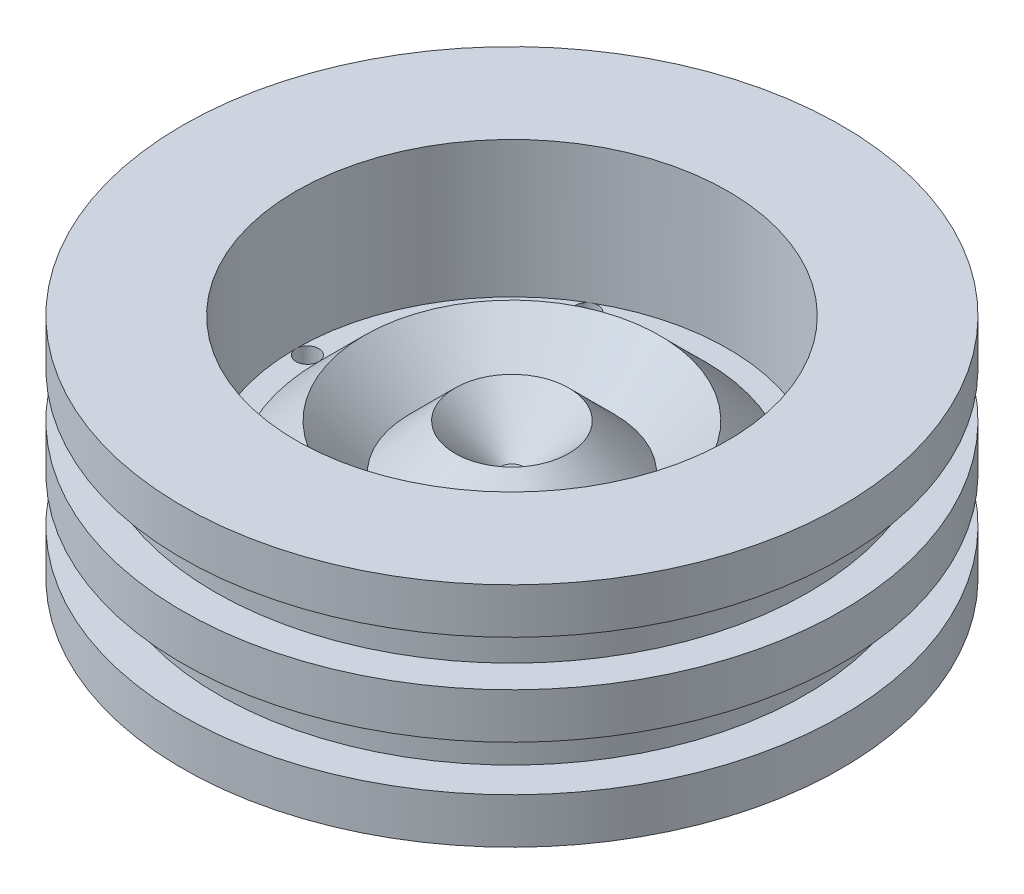
ISO-10303-21;
HEADER;
FILE_DESCRIPTION(('STEP AP214'),'2;1');
FILE_NAME('part.step','',(''),(''),'','','');
FILE_SCHEMA(('AUTOMOTIVE_DESIGN { 1 0 10303 214 1 1 1 1 }'));
ENDSEC;
DATA;
#1=APPLICATION_CONTEXT('core data for automotive mechanical design processes');
#2=APPLICATION_PROTOCOL_DEFINITION('international standard','automotive_design',2000,#1);
#3=PRODUCT_CONTEXT('',#1,'mechanical');
#4=PRODUCT('Part','Part','',(#3));
#5=PRODUCT_RELATED_PRODUCT_CATEGORY('part','',(#4));
#6=PRODUCT_DEFINITION_FORMATION('','',#4);
#7=PRODUCT_DEFINITION_CONTEXT('part definition',#1,'design');
#8=PRODUCT_DEFINITION('design','',#6,#7);
#9=PRODUCT_DEFINITION_SHAPE('','',#8);
#10=(LENGTH_UNIT() NAMED_UNIT(*) SI_UNIT(.MILLI.,.METRE.));
#11=(NAMED_UNIT(*) PLANE_ANGLE_UNIT() SI_UNIT($,.RADIAN.));
#12=(NAMED_UNIT(*) SI_UNIT($,.STERADIAN.) SOLID_ANGLE_UNIT());
#13=UNCERTAINTY_MEASURE_WITH_UNIT(LENGTH_MEASURE(1.E-05),#10,'distance_accuracy_value','');
#14=(GEOMETRIC_REPRESENTATION_CONTEXT(3) GLOBAL_UNCERTAINTY_ASSIGNED_CONTEXT((#13)) GLOBAL_UNIT_ASSIGNED_CONTEXT((#10,
#11,#12)) REPRESENTATION_CONTEXT('',''));
#15=CARTESIAN_POINT('',(0.,0.,0.));
#16=DIRECTION('',(0.,0.,1.));
#17=DIRECTION('',(1.,0.,0.));
#18=AXIS2_PLACEMENT_3D('',#15,#16,#17);
#19=CARTESIAN_POINT('',(0.,20.0000000000005,0.));
#20=DIRECTION('',(0.,-1.,0.));
#21=DIRECTION('',(1.,0.,0.));
#22=AXIS2_PLACEMENT_3D('',#19,#20,#21);
#23=PLANE('',#22);
#24=CARTESIAN_POINT('',(0.,20.0000000000005,0.));
#25=DIRECTION('',(0.,1.,0.));
#26=DIRECTION('',(-1.,0.,0.));
#27=AXIS2_PLACEMENT_3D('',#24,#25,#26);
#28=CIRCLE('',#27,42.5);
#29=CARTESIAN_POINT('',(-42.5,20.0000000000005,0.));
#30=VERTEX_POINT('',#29);
#31=CARTESIAN_POINT('',(-21.2499999999999,20.0000000000005,36.8060796608387));
#32=VERTEX_POINT('',#31);
#33=EDGE_CURVE('E56',#30,#32,#28,.T.);
#34=ORIENTED_EDGE('',*,*,#33,.F.);
#35=CARTESIAN_POINT('',(-45.,20.0000000000005,0.));
#36=DIRECTION('',(0.,-1.,0.));
#37=DIRECTION('',(1.,0.,0.));
#38=AXIS2_PLACEMENT_3D('',#35,#36,#37);
#39=CIRCLE('',#38,2.49999999999999);
#40=CARTESIAN_POINT('',(-47.5,20.0000000000005,0.));
#41=VERTEX_POINT('',#40);
#42=EDGE_CURVE('E186',#30,#41,#39,.T.);
#43=ORIENTED_EDGE('',*,*,#42,.T.);
#44=CARTESIAN_POINT('',(0.,20.0000000000005,0.));
#45=DIRECTION('',(0.,1.,0.));
#46=DIRECTION('',(-1.,0.,0.));
#47=AXIS2_PLACEMENT_3D('',#44,#45,#46);
#48=CIRCLE('',#47,47.5);
#49=CARTESIAN_POINT('',(-23.7499999999999,20.0000000000005,41.1362066797609));
#50=VERTEX_POINT('',#49);
#51=EDGE_CURVE('E128',#41,#50,#48,.T.);
#52=ORIENTED_EDGE('',*,*,#51,.T.);
#53=CARTESIAN_POINT('',(-22.4999999999999,20.0000000000005,38.9711431702998));
#54=DIRECTION('',(0.,-1.,0.));
#55=DIRECTION('',(1.,0.,0.));
#56=AXIS2_PLACEMENT_3D('',#53,#54,#55);
#57=CIRCLE('',#56,2.49999999999999);
#58=EDGE_CURVE('E285',#50,#32,#57,.T.);
#59=ORIENTED_EDGE('',*,*,#58,.T.);
#60=EDGE_LOOP('',(#34,#43,#52,#59));
#61=FACE_BOUND('',#60,.T.);
#62=ADVANCED_FACE('F47',(#61),#23,.F.);
#63=CARTESIAN_POINT('',(21.2499999999997,20.0000000000005,-36.8060796608388));
#64=VERTEX_POINT('',#63);
#65=CARTESIAN_POINT('',(-21.2500000000004,20.0000000000005,-36.8060796608384));
#66=VERTEX_POINT('',#65);
#67=EDGE_CURVE('E150',#64,#66,#28,.T.);
#68=ORIENTED_EDGE('',*,*,#67,.F.);
#69=CARTESIAN_POINT('',(22.4999999999996,20.0000000000005,-38.9711431702999));
#70=DIRECTION('',(0.,-1.,0.));
#71=DIRECTION('',(1.,0.,0.));
#72=AXIS2_PLACEMENT_3D('',#69,#70,#71);
#73=CIRCLE('',#72,2.5);
#74=CARTESIAN_POINT('',(23.7499999999996,20.0000000000005,-41.136206679761));
#75=VERTEX_POINT('',#74);
#76=EDGE_CURVE('E69',#64,#75,#73,.T.);
#77=ORIENTED_EDGE('',*,*,#76,.T.);
#78=CARTESIAN_POINT('',(-23.7500000000005,20.0000000000005,-41.1362066797606));
#79=VERTEX_POINT('',#78);
#80=EDGE_CURVE('E124',#75,#79,#48,.T.);
#81=ORIENTED_EDGE('',*,*,#80,.T.);
#82=CARTESIAN_POINT('',(-22.5000000000005,20.0000000000005,-38.9711431702995));
#83=DIRECTION('',(0.,-1.,0.));
#84=DIRECTION('',(1.,0.,0.));
#85=AXIS2_PLACEMENT_3D('',#82,#83,#84);
#86=CIRCLE('',#85,2.5);
#87=EDGE_CURVE('E98',#79,#66,#86,.T.);
#88=ORIENTED_EDGE('',*,*,#87,.T.);
#89=EDGE_LOOP('',(#68,#77,#81,#88));
#90=FACE_BOUND('',#89,.T.);
#91=ADVANCED_FACE('F132',(#90),#23,.F.);
#92=CARTESIAN_POINT('',(23.7500000000002,20.0000000000005,41.1362066797607));
#93=VERTEX_POINT('',#92);
#94=CARTESIAN_POINT('',(47.5,20.0000000000005,-3.21602851005839E-13));
#95=VERTEX_POINT('',#94);
#96=EDGE_CURVE('E136',#93,#95,#48,.T.);
#97=ORIENTED_EDGE('',*,*,#96,.T.);
#98=CARTESIAN_POINT('',(45.,20.0000000000005,-3.14233320495882E-13));
#99=DIRECTION('',(0.,-1.,0.));
#100=DIRECTION('',(1.,0.,0.));
#101=AXIS2_PLACEMENT_3D('',#98,#99,#100);
#102=CIRCLE('',#101,2.5);
#103=CARTESIAN_POINT('',(42.5,20.0000000000005,-2.96775913801666E-13));
#104=VERTEX_POINT('',#103);
#105=EDGE_CURVE('E169',#95,#104,#102,.T.);
#106=ORIENTED_EDGE('',*,*,#105,.T.);
#107=CARTESIAN_POINT('',(21.2500000000002,20.0000000000005,36.8060796608386));
#108=VERTEX_POINT('',#107);
#109=EDGE_CURVE('E148',#108,#104,#28,.T.);
#110=ORIENTED_EDGE('',*,*,#109,.F.);
#111=CARTESIAN_POINT('',(22.5000000000002,20.0000000000005,38.9711431702996));
#112=DIRECTION('',(0.,-1.,0.));
#113=DIRECTION('',(1.,0.,0.));
#114=AXIS2_PLACEMENT_3D('',#111,#112,#113);
#115=CIRCLE('',#114,2.49999999999999);
#116=EDGE_CURVE('E167',#108,#93,#115,.T.);
#117=ORIENTED_EDGE('',*,*,#116,.T.);
#118=EDGE_LOOP('',(#97,#106,#110,#117));
#119=FACE_BOUND('',#118,.T.);
#120=ADVANCED_FACE('F166',(#119),#23,.F.);
#121=EDGE_CURVE('E139',#50,#93,#48,.T.);
#122=ORIENTED_EDGE('',*,*,#121,.T.);
#123=EDGE_CURVE('E280',#93,#108,#115,.T.);
#124=ORIENTED_EDGE('',*,*,#123,.T.);
#125=EDGE_CURVE('E143',#32,#108,#28,.T.);
#126=ORIENTED_EDGE('',*,*,#125,.F.);
#127=EDGE_CURVE('E118',#32,#50,#57,.T.);
#128=ORIENTED_EDGE('',*,*,#127,.T.);
#129=EDGE_LOOP('',(#122,#124,#126,#128));
#130=FACE_BOUND('',#129,.T.);
#131=ADVANCED_FACE('F268',(#130),#23,.F.);
#132=EDGE_CURVE('E112',#79,#41,#48,.T.);
#133=ORIENTED_EDGE('',*,*,#132,.T.);
#134=EDGE_CURVE('E181',#41,#30,#39,.T.);
#135=ORIENTED_EDGE('',*,*,#134,.T.);
#136=EDGE_CURVE('E115',#66,#30,#28,.T.);
#137=ORIENTED_EDGE('',*,*,#136,.F.);
#138=EDGE_CURVE('E62',#66,#79,#86,.T.);
#139=ORIENTED_EDGE('',*,*,#138,.T.);
#140=EDGE_LOOP('',(#133,#135,#137,#139));
#141=FACE_BOUND('',#140,.T.);
#142=ADVANCED_FACE('F110',(#141),#23,.F.);
#143=CARTESIAN_POINT('',(0.,20.0000000000002,0.));
#144=DIRECTION('',(0.,1.,0.));
#145=DIRECTION('',(-1.,0.,0.));
#146=AXIS2_PLACEMENT_3D('',#143,#144,#145);
#147=CONICAL_SURFACE('',#146,22.5,0.785398163397447);
#148=CARTESIAN_POINT('',(0.,30.0000000000004,0.));
#149=DIRECTION('',(0.,1.,0.));
#150=DIRECTION('',(-1.,0.,0.));
#151=AXIS2_PLACEMENT_3D('',#148,#149,#150);
#152=CIRCLE('',#151,32.5000000000001);
#153=CARTESIAN_POINT('',(-32.5000000000001,30.0000000000004,0.));
#154=VERTEX_POINT('',#153);
#155=EDGE_CURVE('E11',#154,#154,#152,.T.);
#156=ORIENTED_EDGE('',*,*,#155,.T.);
#157=EDGE_LOOP('',(#156));
#158=FACE_BOUND('',#157,.T.);
#159=CARTESIAN_POINT('',(0.,20.0000000000002,0.));
#160=DIRECTION('',(0.,1.,0.));
#161=DIRECTION('',(-1.,0.,0.));
#162=AXIS2_PLACEMENT_3D('',#159,#160,#161);
#163=CIRCLE('',#162,22.5);
#164=CARTESIAN_POINT('',(-22.5,20.0000000000002,0.));
#165=VERTEX_POINT('',#164);
#166=EDGE_CURVE('E187',#165,#165,#163,.T.);
#167=ORIENTED_EDGE('',*,*,#166,.F.);
#168=EDGE_LOOP('',(#167));
#169=FACE_BOUND('',#168,.T.);
#170=ADVANCED_FACE('F49',(#158,#169),#147,.F.);
#171=CARTESIAN_POINT('',(0.,30.0000000000004,0.));
#172=DIRECTION('',(0.,-1.,0.));
#173=DIRECTION('',(1.,0.,0.));
#174=AXIS2_PLACEMENT_3D('',#171,#172,#173);
#175=CONICAL_SURFACE('',#174,32.5000000000001,0.785398163397449);
#176=ORIENTED_EDGE('',*,*,#33,.T.);
#177=ORIENTED_EDGE('',*,*,#125,.T.);
#178=ORIENTED_EDGE('',*,*,#109,.T.);
#179=EDGE_CURVE('E152',#104,#64,#28,.T.);
#180=ORIENTED_EDGE('',*,*,#179,.T.);
#181=ORIENTED_EDGE('',*,*,#67,.T.);
#182=ORIENTED_EDGE('',*,*,#136,.T.);
#183=EDGE_LOOP('',(#176,#177,#178,#180,#181,#182));
#184=FACE_BOUND('',#183,.T.);
#185=ORIENTED_EDGE('',*,*,#155,.F.);
#186=EDGE_LOOP('',(#185));
#187=FACE_BOUND('',#186,.T.);
#188=ADVANCED_FACE('F159',(#184,#187),#175,.T.);
#189=EDGE_CURVE('E134',#95,#75,#48,.T.);
#190=ORIENTED_EDGE('',*,*,#189,.T.);
#191=EDGE_CURVE('E173',#75,#64,#73,.T.);
#192=ORIENTED_EDGE('',*,*,#191,.T.);
#193=ORIENTED_EDGE('',*,*,#179,.F.);
#194=EDGE_CURVE('E174',#104,#95,#102,.T.);
#195=ORIENTED_EDGE('',*,*,#194,.T.);
#196=EDGE_LOOP('',(#190,#192,#193,#195));
#197=FACE_BOUND('',#196,.T.);
#198=ADVANCED_FACE('F177',(#197),#23,.F.);
#199=CARTESIAN_POINT('',(0.,20.,0.));
#200=DIRECTION('',(0.,1.,0.));
#201=DIRECTION('',(-1.,0.,0.));
#202=AXIS2_PLACEMENT_3D('',#199,#200,#201);
#203=CYLINDRICAL_SURFACE('',#202,47.5);
#204=ORIENTED_EDGE('',*,*,#51,.F.);
#205=ORIENTED_EDGE('',*,*,#132,.F.);
#206=ORIENTED_EDGE('',*,*,#80,.F.);
#207=ORIENTED_EDGE('',*,*,#189,.F.);
#208=ORIENTED_EDGE('',*,*,#96,.F.);
#209=ORIENTED_EDGE('',*,*,#121,.F.);
#210=EDGE_LOOP('',(#204,#205,#206,#207,#208,#209));
#211=FACE_BOUND('',#210,.T.);
#212=CARTESIAN_POINT('',(0.,50.0000000000005,0.));
#213=DIRECTION('',(0.,1.,0.));
#214=DIRECTION('',(-1.,0.,0.));
#215=AXIS2_PLACEMENT_3D('',#212,#213,#214);
#216=CIRCLE('',#215,47.5);
#217=CARTESIAN_POINT('',(-47.5,50.0000000000005,0.));
#218=VERTEX_POINT('',#217);
#219=EDGE_CURVE('E130',#218,#218,#216,.T.);
#220=ORIENTED_EDGE('',*,*,#219,.T.);
#221=EDGE_LOOP('',(#220));
#222=FACE_BOUND('',#221,.T.);
#223=ADVANCED_FACE('F121',(#211,#222),#203,.F.);
#224=CARTESIAN_POINT('',(0.,50.0000000000005,0.));
#225=DIRECTION('',(0.,-1.,0.));
#226=DIRECTION('',(1.,0.,0.));
#227=AXIS2_PLACEMENT_3D('',#224,#225,#226);
#228=PLANE('',#227);
#229=ORIENTED_EDGE('',*,*,#219,.F.);
#230=EDGE_LOOP('',(#229));
#231=FACE_BOUND('',#230,.T.);
#232=CARTESIAN_POINT('',(0.,50.0000000000005,0.));
#233=DIRECTION('',(0.,1.,0.));
#234=DIRECTION('',(-1.,0.,0.));
#235=AXIS2_PLACEMENT_3D('',#232,#233,#234);
#236=CIRCLE('',#235,72.5);
#237=CARTESIAN_POINT('',(-72.5,50.0000000000005,0.));
#238=VERTEX_POINT('',#237);
#239=EDGE_CURVE('E234',#238,#238,#236,.T.);
#240=ORIENTED_EDGE('',*,*,#239,.T.);
#241=EDGE_LOOP('',(#240));
#242=FACE_BOUND('',#241,.T.);
#243=ADVANCED_FACE('F243',(#231,#242),#228,.F.);
#244=CARTESIAN_POINT('',(0.,20.,0.));
#245=DIRECTION('',(0.,1.,0.));
#246=DIRECTION('',(-1.,0.,0.));
#247=AXIS2_PLACEMENT_3D('',#244,#245,#246);
#248=CYLINDRICAL_SURFACE('',#247,72.5);
#249=ORIENTED_EDGE('',*,*,#239,.F.);
#250=EDGE_LOOP('',(#249));
#251=FACE_BOUND('',#250,.T.);
#252=CARTESIAN_POINT('',(0.,40.,0.));
#253=DIRECTION('',(0.,1.,0.));
#254=DIRECTION('',(-1.,0.,0.));
#255=AXIS2_PLACEMENT_3D('',#252,#253,#254);
#256=CIRCLE('',#255,72.5);
#257=CARTESIAN_POINT('',(-72.5,40.,0.));
#258=VERTEX_POINT('',#257);
#259=EDGE_CURVE('E231',#258,#258,#256,.T.);
#260=ORIENTED_EDGE('',*,*,#259,.T.);
#261=EDGE_LOOP('',(#260));
#262=FACE_BOUND('',#261,.T.);
#263=ADVANCED_FACE('F245',(#251,#262),#248,.T.);
#264=CARTESIAN_POINT('',(0.,40.,0.));
#265=DIRECTION('',(0.,1.,0.));
#266=DIRECTION('',(-1.,0.,0.));
#267=AXIS2_PLACEMENT_3D('',#264,#265,#266);
#268=PLANE('',#267);
#269=ORIENTED_EDGE('',*,*,#259,.F.);
#270=EDGE_LOOP('',(#269));
#271=FACE_BOUND('',#270,.T.);
#272=CARTESIAN_POINT('',(0.,40.,0.));
#273=DIRECTION('',(0.,1.,0.));
#274=DIRECTION('',(-1.,0.,0.));
#275=AXIS2_PLACEMENT_3D('',#272,#273,#274);
#276=CIRCLE('',#275,65.3262853855471);
#277=CARTESIAN_POINT('',(-65.3262853855471,40.,0.));
#278=VERTEX_POINT('',#277);
#279=EDGE_CURVE('E227',#278,#278,#276,.T.);
#280=ORIENTED_EDGE('',*,*,#279,.T.);
#281=EDGE_LOOP('',(#280));
#282=FACE_BOUND('',#281,.T.);
#283=ADVANCED_FACE('F251',(#271,#282),#268,.F.);
#284=CARTESIAN_POINT('',(0.,20.,0.));
#285=DIRECTION('',(0.,1.,0.));
#286=DIRECTION('',(-1.,0.,0.));
#287=AXIS2_PLACEMENT_3D('',#284,#285,#286);
#288=CYLINDRICAL_SURFACE('',#287,65.3262853855471);
#289=ORIENTED_EDGE('',*,*,#279,.F.);
#290=EDGE_LOOP('',(#289));
#291=FACE_BOUND('',#290,.T.);
#292=CARTESIAN_POINT('',(0.,30.,0.));
#293=DIRECTION('',(0.,1.,0.));
#294=DIRECTION('',(-1.,0.,0.));
#295=AXIS2_PLACEMENT_3D('',#292,#293,#294);
#296=CIRCLE('',#295,65.3262853855471);
#297=CARTESIAN_POINT('',(-65.3262853855471,30.,0.));
#298=VERTEX_POINT('',#297);
#299=EDGE_CURVE('E223',#298,#298,#296,.T.);
#300=ORIENTED_EDGE('',*,*,#299,.T.);
#301=EDGE_LOOP('',(#300));
#302=FACE_BOUND('',#301,.T.);
#303=ADVANCED_FACE('F353',(#291,#302),#288,.T.);
#304=CARTESIAN_POINT('',(0.,30.,0.));
#305=DIRECTION('',(0.,-1.,0.));
#306=DIRECTION('',(1.,0.,0.));
#307=AXIS2_PLACEMENT_3D('',#304,#305,#306);
#308=PLANE('',#307);
#309=ORIENTED_EDGE('',*,*,#299,.F.);
#310=EDGE_LOOP('',(#309));
#311=FACE_BOUND('',#310,.T.);
#312=CARTESIAN_POINT('',(0.,30.,0.));
#313=DIRECTION('',(0.,1.,0.));
#314=DIRECTION('',(-1.,0.,0.));
#315=AXIS2_PLACEMENT_3D('',#312,#313,#314);
#316=CIRCLE('',#315,72.5);
#317=CARTESIAN_POINT('',(-72.5,30.,0.));
#318=VERTEX_POINT('',#317);
#319=EDGE_CURVE('E219',#318,#318,#316,.T.);
#320=ORIENTED_EDGE('',*,*,#319,.T.);
#321=EDGE_LOOP('',(#320));
#322=FACE_BOUND('',#321,.T.);
#323=ADVANCED_FACE('F349',(#311,#322),#308,.F.);
#324=CARTESIAN_POINT('',(0.,20.,0.));
#325=DIRECTION('',(0.,1.,0.));
#326=DIRECTION('',(-1.,0.,0.));
#327=AXIS2_PLACEMENT_3D('',#324,#325,#326);
#328=CYLINDRICAL_SURFACE('',#327,72.5);
#329=ORIENTED_EDGE('',*,*,#319,.F.);
#330=EDGE_LOOP('',(#329));
#331=FACE_BOUND('',#330,.T.);
#332=CARTESIAN_POINT('',(0.,20.,0.));
#333=DIRECTION('',(0.,1.,0.));
#334=DIRECTION('',(-1.,0.,0.));
#335=AXIS2_PLACEMENT_3D('',#332,#333,#334);
#336=CIRCLE('',#335,72.5);
#337=CARTESIAN_POINT('',(-72.5,20.,0.));
#338=VERTEX_POINT('',#337);
#339=EDGE_CURVE('E215',#338,#338,#336,.T.);
#340=ORIENTED_EDGE('',*,*,#339,.T.);
#341=EDGE_LOOP('',(#340));
#342=FACE_BOUND('',#341,.T.);
#343=ADVANCED_FACE('F345',(#331,#342),#328,.T.);
#344=CARTESIAN_POINT('',(0.,20.,0.));
#345=DIRECTION('',(0.,1.,0.));
#346=DIRECTION('',(-1.,0.,0.));
#347=AXIS2_PLACEMENT_3D('',#344,#345,#346);
#348=PLANE('',#347);
#349=ORIENTED_EDGE('',*,*,#339,.F.);
#350=EDGE_LOOP('',(#349));
#351=FACE_BOUND('',#350,.T.);
#352=CARTESIAN_POINT('',(0.,20.,0.));
#353=DIRECTION('',(0.,1.,0.));
#354=DIRECTION('',(-1.,0.,0.));
#355=AXIS2_PLACEMENT_3D('',#352,#353,#354);
#356=CIRCLE('',#355,64.5);
#357=CARTESIAN_POINT('',(-64.5,20.,0.));
#358=VERTEX_POINT('',#357);
#359=EDGE_CURVE('E211',#358,#358,#356,.T.);
#360=ORIENTED_EDGE('',*,*,#359,.T.);
#361=EDGE_LOOP('',(#360));
#362=FACE_BOUND('',#361,.T.);
#363=ADVANCED_FACE('F341',(#351,#362),#348,.F.);
#364=CARTESIAN_POINT('',(0.,20.,0.));
#365=DIRECTION('',(0.,1.,0.));
#366=DIRECTION('',(-1.,0.,0.));
#367=AXIS2_PLACEMENT_3D('',#364,#365,#366);
#368=CYLINDRICAL_SURFACE('',#367,64.5);
#369=ORIENTED_EDGE('',*,*,#359,.F.);
#370=EDGE_LOOP('',(#369));
#371=FACE_BOUND('',#370,.T.);
#372=CARTESIAN_POINT('',(0.,9.99999999999999,0.));
#373=DIRECTION('',(0.,1.,0.));
#374=DIRECTION('',(-1.,0.,0.));
#375=AXIS2_PLACEMENT_3D('',#372,#373,#374);
#376=CIRCLE('',#375,64.5);
#377=CARTESIAN_POINT('',(-64.5,9.99999999999999,0.));
#378=VERTEX_POINT('',#377);
#379=EDGE_CURVE('E207',#378,#378,#376,.T.);
#380=ORIENTED_EDGE('',*,*,#379,.T.);
#381=EDGE_LOOP('',(#380));
#382=FACE_BOUND('',#381,.T.);
#383=ADVANCED_FACE('F337',(#371,#382),#368,.T.);
#384=CARTESIAN_POINT('',(0.,9.99999999999999,0.));
#385=DIRECTION('',(0.,-1.,0.));
#386=DIRECTION('',(1.,0.,0.));
#387=AXIS2_PLACEMENT_3D('',#384,#385,#386);
#388=PLANE('',#387);
#389=ORIENTED_EDGE('',*,*,#379,.F.);
#390=EDGE_LOOP('',(#389));
#391=FACE_BOUND('',#390,.T.);
#392=CARTESIAN_POINT('',(0.,9.99999999999999,0.));
#393=DIRECTION('',(0.,1.,0.));
#394=DIRECTION('',(-1.,0.,0.));
#395=AXIS2_PLACEMENT_3D('',#392,#393,#394);
#396=CIRCLE('',#395,72.5);
#397=CARTESIAN_POINT('',(-72.5,9.99999999999999,0.));
#398=VERTEX_POINT('',#397);
#399=EDGE_CURVE('E203',#398,#398,#396,.T.);
#400=ORIENTED_EDGE('',*,*,#399,.T.);
#401=EDGE_LOOP('',(#400));
#402=FACE_BOUND('',#401,.T.);
#403=ADVANCED_FACE('F333',(#391,#402),#388,.F.);
#404=CARTESIAN_POINT('',(0.,20.,0.));
#405=DIRECTION('',(0.,1.,0.));
#406=DIRECTION('',(-1.,0.,0.));
#407=AXIS2_PLACEMENT_3D('',#404,#405,#406);
#408=CYLINDRICAL_SURFACE('',#407,72.5);
#409=ORIENTED_EDGE('',*,*,#399,.F.);
#410=EDGE_LOOP('',(#409));
#411=FACE_BOUND('',#410,.T.);
#412=CARTESIAN_POINT('',(0.,0.,0.));
#413=DIRECTION('',(0.,1.,0.));
#414=DIRECTION('',(-1.,0.,0.));
#415=AXIS2_PLACEMENT_3D('',#412,#413,#414);
#416=CIRCLE('',#415,72.5);
#417=CARTESIAN_POINT('',(-72.5,0.,0.));
#418=VERTEX_POINT('',#417);
#419=EDGE_CURVE('E199',#418,#418,#416,.T.);
#420=ORIENTED_EDGE('',*,*,#419,.T.);
#421=EDGE_LOOP('',(#420));
#422=FACE_BOUND('',#421,.T.);
#423=ADVANCED_FACE('F329',(#411,#422),#408,.T.);
#424=CARTESIAN_POINT('',(0.,0.,0.));
#425=DIRECTION('',(0.,1.,0.));
#426=DIRECTION('',(-1.,0.,0.));
#427=AXIS2_PLACEMENT_3D('',#424,#425,#426);
#428=PLANE('',#427);
#429=CARTESIAN_POINT('',(-45.,0.,0.));
#430=DIRECTION('',(0.,-1.,0.));
#431=DIRECTION('',(1.,0.,0.));
#432=AXIS2_PLACEMENT_3D('',#429,#430,#431);
#433=CIRCLE('',#432,2.49999999999999);
#434=CARTESIAN_POINT('',(-42.5,0.,0.));
#435=VERTEX_POINT('',#434);
#436=EDGE_CURVE('E105',#435,#435,#433,.T.);
#437=ORIENTED_EDGE('',*,*,#436,.F.);
#438=EDGE_LOOP('',(#437));
#439=FACE_BOUND('',#438,.T.);
#440=CARTESIAN_POINT('',(22.4999999999996,0.,-38.9711431702999));
#441=DIRECTION('',(0.,-1.,0.));
#442=DIRECTION('',(1.,0.,0.));
#443=AXIS2_PLACEMENT_3D('',#440,#441,#442);
#444=CIRCLE('',#443,2.5);
#445=CARTESIAN_POINT('',(24.9999999999996,0.,-38.9711431702999));
#446=VERTEX_POINT('',#445);
#447=EDGE_CURVE('E549',#446,#446,#444,.T.);
#448=ORIENTED_EDGE('',*,*,#447,.F.);
#449=EDGE_LOOP('',(#448));
#450=FACE_BOUND('',#449,.T.);
#451=CARTESIAN_POINT('',(45.,0.,-3.14233320495882E-13));
#452=DIRECTION('',(0.,-1.,0.));
#453=DIRECTION('',(1.,0.,0.));
#454=AXIS2_PLACEMENT_3D('',#451,#452,#453);
#455=CIRCLE('',#454,2.5);
#456=CARTESIAN_POINT('',(47.5,0.,-3.14233320495882E-13));
#457=VERTEX_POINT('',#456);
#458=EDGE_CURVE('E553',#457,#457,#455,.T.);
#459=ORIENTED_EDGE('',*,*,#458,.F.);
#460=EDGE_LOOP('',(#459));
#461=FACE_BOUND('',#460,.T.);
#462=CARTESIAN_POINT('',(22.5000000000002,0.,38.9711431702996));
#463=DIRECTION('',(0.,-1.,0.));
#464=DIRECTION('',(1.,0.,0.));
#465=AXIS2_PLACEMENT_3D('',#462,#463,#464);
#466=CIRCLE('',#465,2.49999999999999);
#467=CARTESIAN_POINT('',(25.0000000000002,0.,38.9711431702996));
#468=VERTEX_POINT('',#467);
#469=EDGE_CURVE('E557',#468,#468,#466,.T.);
#470=ORIENTED_EDGE('',*,*,#469,.F.);
#471=EDGE_LOOP('',(#470));
#472=FACE_BOUND('',#471,.T.);
#473=CARTESIAN_POINT('',(-22.4999999999999,0.,38.9711431702998));
#474=DIRECTION('',(0.,-1.,0.));
#475=DIRECTION('',(1.,0.,0.));
#476=AXIS2_PLACEMENT_3D('',#473,#474,#475);
#477=CIRCLE('',#476,2.49999999999999);
#478=CARTESIAN_POINT('',(-19.9999999999999,0.,38.9711431702998));
#479=VERTEX_POINT('',#478);
#480=EDGE_CURVE('E561',#479,#479,#477,.T.);
#481=ORIENTED_EDGE('',*,*,#480,.F.);
#482=EDGE_LOOP('',(#481));
#483=FACE_BOUND('',#482,.T.);
#484=CARTESIAN_POINT('',(-22.5000000000005,0.,-38.9711431702995));
#485=DIRECTION('',(0.,-1.,0.));
#486=DIRECTION('',(1.,0.,0.));
#487=AXIS2_PLACEMENT_3D('',#484,#485,#486);
#488=CIRCLE('',#487,2.5);
#489=CARTESIAN_POINT('',(-20.0000000000005,0.,-38.9711431702995));
#490=VERTEX_POINT('',#489);
#491=EDGE_CURVE('E564',#490,#490,#488,.T.);
#492=ORIENTED_EDGE('',*,*,#491,.F.);
#493=EDGE_LOOP('',(#492));
#494=FACE_BOUND('',#493,.T.);
#495=ORIENTED_EDGE('',*,*,#419,.F.);
#496=EDGE_LOOP('',(#495));
#497=FACE_BOUND('',#496,.T.);
#498=ADVANCED_FACE('F325',(#439,#450,#461,#472,#483,#494,#497),#428,.F.);
#499=CARTESIAN_POINT('',(4.16333634234436E-13,20.,0.));
#500=DIRECTION('',(0.,-1.,0.));
#501=DIRECTION('',(1.,0.,0.));
#502=AXIS2_PLACEMENT_3D('',#499,#500,#501);
#503=PLANE('',#502);
#504=CARTESIAN_POINT('',(0.,20.0000000000001,0.));
#505=DIRECTION('',(0.,1.,0.));
#506=DIRECTION('',(-1.,0.,0.));
#507=AXIS2_PLACEMENT_3D('',#504,#505,#506);
#508=CIRCLE('',#507,2.49999999999999);
#509=CARTESIAN_POINT('',(-2.49999999999999,20.0000000000001,0.));
#510=VERTEX_POINT('',#509);
#511=EDGE_CURVE('E195',#510,#510,#508,.T.);
#512=ORIENTED_EDGE('',*,*,#511,.T.);
#513=EDGE_LOOP('',(#512));
#514=FACE_BOUND('',#513,.T.);
#515=ADVANCED_FACE('F321',(#514),#503,.F.);
#516=CARTESIAN_POINT('',(0.,30.0000000000001,0.));
#517=DIRECTION('',(0.,1.,0.));
#518=DIRECTION('',(-1.,0.,0.));
#519=AXIS2_PLACEMENT_3D('',#516,#517,#518);
#520=CONICAL_SURFACE('',#519,12.5000000000001,0.785398163397451);
#521=ORIENTED_EDGE('',*,*,#511,.F.);
#522=EDGE_LOOP('',(#521));
#523=FACE_BOUND('',#522,.T.);
#524=CARTESIAN_POINT('',(0.,30.0000000000001,0.));
#525=DIRECTION('',(0.,1.,0.));
#526=DIRECTION('',(-1.,0.,0.));
#527=AXIS2_PLACEMENT_3D('',#524,#525,#526);
#528=CIRCLE('',#527,12.5000000000001);
#529=CARTESIAN_POINT('',(-12.5000000000001,30.0000000000001,0.));
#530=VERTEX_POINT('',#529);
#531=EDGE_CURVE('E191',#530,#530,#528,.T.);
#532=ORIENTED_EDGE('',*,*,#531,.T.);
#533=EDGE_LOOP('',(#532));
#534=FACE_BOUND('',#533,.T.);
#535=ADVANCED_FACE('F317',(#523,#534),#520,.F.);
#536=CARTESIAN_POINT('',(0.,30.0000000000001,0.));
#537=DIRECTION('',(0.,-1.,0.));
#538=DIRECTION('',(1.,0.,0.));
#539=AXIS2_PLACEMENT_3D('',#536,#537,#538);
#540=CONICAL_SURFACE('',#539,12.5000000000001,0.785398163397449);
#541=ORIENTED_EDGE('',*,*,#166,.T.);
#542=EDGE_LOOP('',(#541));
#543=FACE_BOUND('',#542,.T.);
#544=ORIENTED_EDGE('',*,*,#531,.F.);
#545=EDGE_LOOP('',(#544));
#546=FACE_BOUND('',#545,.T.);
#547=ADVANCED_FACE('F304',(#543,#546),#540,.T.);
#548=CARTESIAN_POINT('',(-22.5000000000005,30.,-38.9711431702995));
#549=DIRECTION('',(0.,-1.,0.));
#550=DIRECTION('',(1.,0.,0.));
#551=AXIS2_PLACEMENT_3D('',#548,#549,#550);
#552=CYLINDRICAL_SURFACE('',#551,2.5);
#553=ORIENTED_EDGE('',*,*,#491,.T.);
#554=EDGE_LOOP('',(#553));
#555=FACE_BOUND('',#554,.T.);
#556=ORIENTED_EDGE('',*,*,#87,.F.);
#557=ORIENTED_EDGE('',*,*,#138,.F.);
#558=EDGE_LOOP('',(#556,#557));
#559=FACE_BOUND('',#558,.T.);
#560=ADVANCED_FACE('F99',(#555,#559),#552,.F.);
#561=CARTESIAN_POINT('',(-22.4999999999999,30.,38.9711431702998));
#562=DIRECTION('',(0.,-1.,0.));
#563=DIRECTION('',(1.,0.,0.));
#564=AXIS2_PLACEMENT_3D('',#561,#562,#563);
#565=CYLINDRICAL_SURFACE('',#564,2.49999999999999);
#566=ORIENTED_EDGE('',*,*,#480,.T.);
#567=EDGE_LOOP('',(#566));
#568=FACE_BOUND('',#567,.T.);
#569=ORIENTED_EDGE('',*,*,#127,.F.);
#570=ORIENTED_EDGE('',*,*,#58,.F.);
#571=EDGE_LOOP('',(#569,#570));
#572=FACE_BOUND('',#571,.T.);
#573=ADVANCED_FACE('F303',(#568,#572),#565,.F.);
#574=CARTESIAN_POINT('',(22.5000000000002,30.,38.9711431702996));
#575=DIRECTION('',(0.,-1.,0.));
#576=DIRECTION('',(1.,0.,0.));
#577=AXIS2_PLACEMENT_3D('',#574,#575,#576);
#578=CYLINDRICAL_SURFACE('',#577,2.49999999999999);
#579=ORIENTED_EDGE('',*,*,#469,.T.);
#580=EDGE_LOOP('',(#579));
#581=FACE_BOUND('',#580,.T.);
#582=ORIENTED_EDGE('',*,*,#116,.F.);
#583=ORIENTED_EDGE('',*,*,#123,.F.);
#584=EDGE_LOOP('',(#582,#583));
#585=FACE_BOUND('',#584,.T.);
#586=ADVANCED_FACE('F308',(#581,#585),#578,.F.);
#587=CARTESIAN_POINT('',(45.,30.,-3.14233320495882E-13));
#588=DIRECTION('',(0.,-1.,0.));
#589=DIRECTION('',(1.,0.,0.));
#590=AXIS2_PLACEMENT_3D('',#587,#588,#589);
#591=CYLINDRICAL_SURFACE('',#590,2.5);
#592=ORIENTED_EDGE('',*,*,#458,.T.);
#593=EDGE_LOOP('',(#592));
#594=FACE_BOUND('',#593,.T.);
#595=ORIENTED_EDGE('',*,*,#194,.F.);
#596=ORIENTED_EDGE('',*,*,#105,.F.);
#597=EDGE_LOOP('',(#595,#596));
#598=FACE_BOUND('',#597,.T.);
#599=ADVANCED_FACE('F296',(#594,#598),#591,.F.);
#600=CARTESIAN_POINT('',(22.4999999999996,30.,-38.9711431702999));
#601=DIRECTION('',(0.,-1.,0.));
#602=DIRECTION('',(1.,0.,0.));
#603=AXIS2_PLACEMENT_3D('',#600,#601,#602);
#604=CYLINDRICAL_SURFACE('',#603,2.5);
#605=ORIENTED_EDGE('',*,*,#447,.T.);
#606=EDGE_LOOP('',(#605));
#607=FACE_BOUND('',#606,.T.);
#608=ORIENTED_EDGE('',*,*,#191,.F.);
#609=ORIENTED_EDGE('',*,*,#76,.F.);
#610=EDGE_LOOP('',(#608,#609));
#611=FACE_BOUND('',#610,.T.);
#612=ADVANCED_FACE('F290',(#607,#611),#604,.F.);
#613=CARTESIAN_POINT('',(-45.,30.,0.));
#614=DIRECTION('',(0.,-1.,0.));
#615=DIRECTION('',(1.,0.,0.));
#616=AXIS2_PLACEMENT_3D('',#613,#614,#615);
#617=CYLINDRICAL_SURFACE('',#616,2.49999999999999);
#618=ORIENTED_EDGE('',*,*,#436,.T.);
#619=EDGE_LOOP('',(#618));
#620=FACE_BOUND('',#619,.T.);
#621=ORIENTED_EDGE('',*,*,#134,.F.);
#622=ORIENTED_EDGE('',*,*,#42,.F.);
#623=EDGE_LOOP('',(#621,#622));
#624=FACE_BOUND('',#623,.T.);
#625=ADVANCED_FACE('F288',(#620,#624),#617,.F.);
#626=CLOSED_SHELL('',(#62,#91,#120,#131,#142,#170,#188,#198,#223,#243,#263,#283,#303,#323,#343,
#363,#383,#403,#423,#498,#515,#535,#547,#560,#573,#586,#599,#612,#625));
#627=MANIFOLD_SOLID_BREP('B2',#626);
#628=ADVANCED_BREP_SHAPE_REPRESENTATION('',(#18,#627),#14);
#629=SHAPE_DEFINITION_REPRESENTATION(#9,#628);
ENDSEC;
END-ISO-10303-21;
